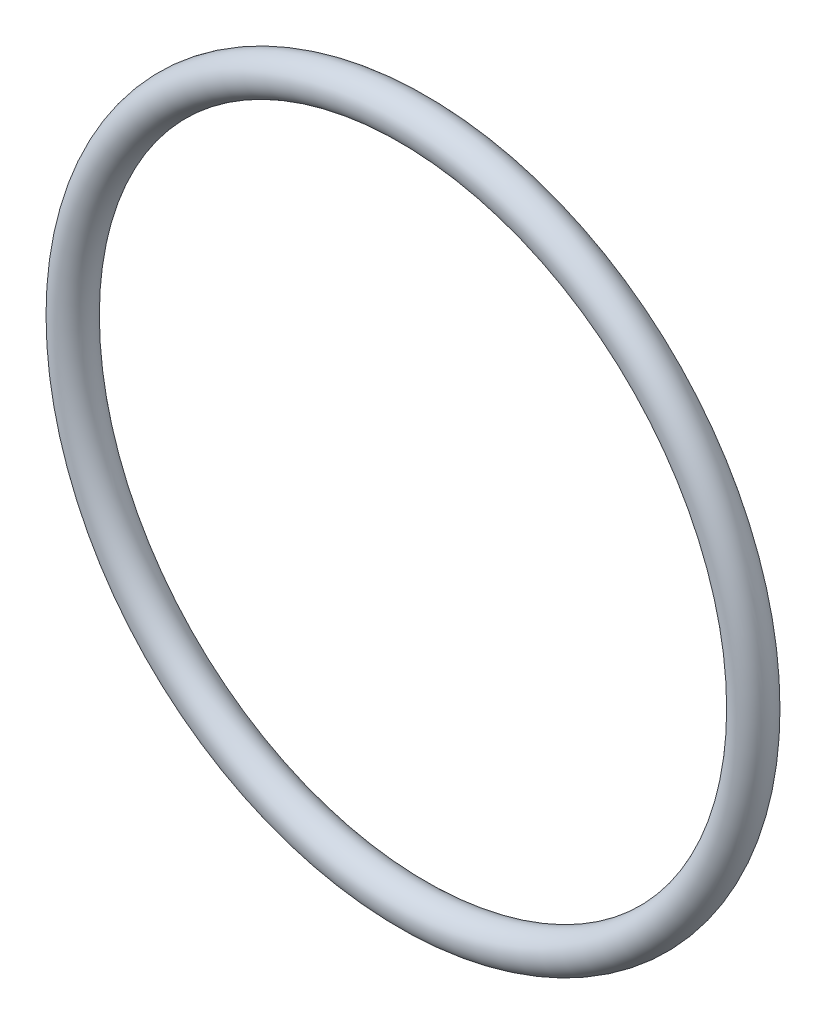
ISO-10303-21;
HEADER;
FILE_DESCRIPTION(('STEP AP214'),'2;1');
FILE_NAME('part.step','',(''),(''),'','','');
FILE_SCHEMA(('AUTOMOTIVE_DESIGN { 1 0 10303 214 1 1 1 1 }'));
ENDSEC;
DATA;
#1=APPLICATION_CONTEXT('core data for automotive mechanical design processes');
#2=APPLICATION_PROTOCOL_DEFINITION('international standard','automotive_design',2000,#1);
#3=PRODUCT_CONTEXT('',#1,'mechanical');
#4=PRODUCT('Part','Part','',(#3));
#5=PRODUCT_RELATED_PRODUCT_CATEGORY('part','',(#4));
#6=PRODUCT_DEFINITION_FORMATION('','',#4);
#7=PRODUCT_DEFINITION_CONTEXT('part definition',#1,'design');
#8=PRODUCT_DEFINITION('design','',#6,#7);
#9=PRODUCT_DEFINITION_SHAPE('','',#8);
#10=(LENGTH_UNIT() NAMED_UNIT(*) SI_UNIT(.MILLI.,.METRE.));
#11=(NAMED_UNIT(*) PLANE_ANGLE_UNIT() SI_UNIT($,.RADIAN.));
#12=(NAMED_UNIT(*) SI_UNIT($,.STERADIAN.) SOLID_ANGLE_UNIT());
#13=UNCERTAINTY_MEASURE_WITH_UNIT(LENGTH_MEASURE(1.E-05),#10,'distance_accuracy_value','');
#14=(GEOMETRIC_REPRESENTATION_CONTEXT(3) GLOBAL_UNCERTAINTY_ASSIGNED_CONTEXT((#13)) GLOBAL_UNIT_ASSIGNED_CONTEXT((#10,
#11,#12)) REPRESENTATION_CONTEXT('',''));
#15=CARTESIAN_POINT('',(0.,0.,0.));
#16=DIRECTION('',(0.,0.,1.));
#17=DIRECTION('',(1.,0.,0.));
#18=AXIS2_PLACEMENT_3D('',#15,#16,#17);
#19=CARTESIAN_POINT('',(-4.14553577050644,10.1153027458822,30.8937360424227));
#20=DIRECTION('',(0.,0.,1.));
#21=DIRECTION('',(1.,0.,0.));
#22=AXIS2_PLACEMENT_3D('',#19,#20,#21);
#23=TOROIDAL_SURFACE('',#22,45.0934294572382,2.5);
#24=CARTESIAN_POINT('',(43.4478936867318,10.1153027458822,30.8937360424227));
#25=VERTEX_POINT('',#24);
#26=VERTEX_LOOP('',#25);
#27=FACE_BOUND('',#26,.T.);
#28=ADVANCED_FACE('F28',(#27),#23,.T.);
#29=CLOSED_SHELL('',(#28));
#30=MANIFOLD_SOLID_BREP('B2',#29);
#31=ADVANCED_BREP_SHAPE_REPRESENTATION('',(#18,#30),#14);
#32=SHAPE_DEFINITION_REPRESENTATION(#9,#31);
ENDSEC;
END-ISO-10303-21;
